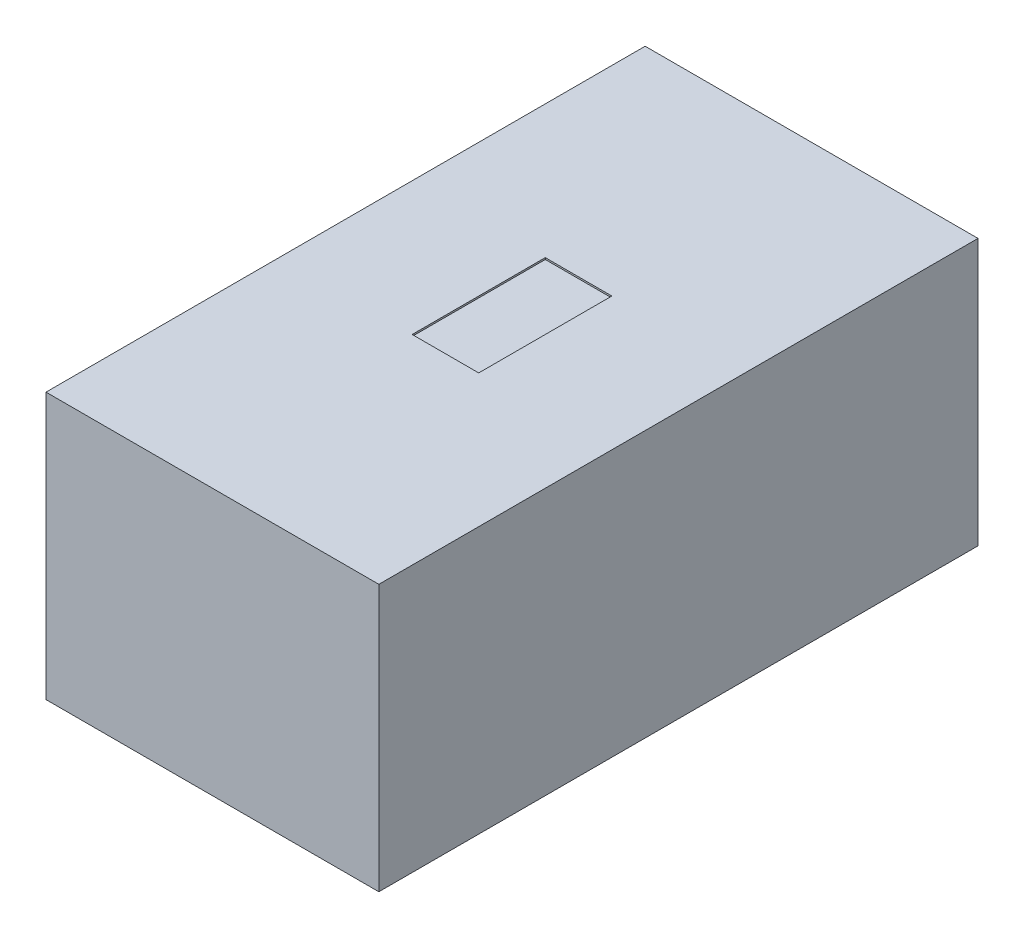
ISO-10303-21;
HEADER;
FILE_DESCRIPTION(('STEP AP214'),'2;1');
FILE_NAME('part.step','',(''),(''),'','','');
FILE_SCHEMA(('AUTOMOTIVE_DESIGN { 1 0 10303 214 1 1 1 1 }'));
ENDSEC;
DATA;
#1=APPLICATION_CONTEXT('core data for automotive mechanical design processes');
#2=APPLICATION_PROTOCOL_DEFINITION('international standard','automotive_design',2000,#1);
#3=PRODUCT_CONTEXT('',#1,'mechanical');
#4=PRODUCT('Part','Part','',(#3));
#5=PRODUCT_RELATED_PRODUCT_CATEGORY('part','',(#4));
#6=PRODUCT_DEFINITION_FORMATION('','',#4);
#7=PRODUCT_DEFINITION_CONTEXT('part definition',#1,'design');
#8=PRODUCT_DEFINITION('design','',#6,#7);
#9=PRODUCT_DEFINITION_SHAPE('','',#8);
#10=(LENGTH_UNIT() NAMED_UNIT(*) SI_UNIT(.MILLI.,.METRE.));
#11=(NAMED_UNIT(*) PLANE_ANGLE_UNIT() SI_UNIT($,.RADIAN.));
#12=(NAMED_UNIT(*) SI_UNIT($,.STERADIAN.) SOLID_ANGLE_UNIT());
#13=UNCERTAINTY_MEASURE_WITH_UNIT(LENGTH_MEASURE(1.E-05),#10,'distance_accuracy_value','');
#14=(GEOMETRIC_REPRESENTATION_CONTEXT(3) GLOBAL_UNCERTAINTY_ASSIGNED_CONTEXT((#13)) GLOBAL_UNIT_ASSIGNED_CONTEXT((#10,
#11,#12)) REPRESENTATION_CONTEXT('',''));
#15=CARTESIAN_POINT('',(0.,0.,0.));
#16=DIRECTION('',(0.,0.,1.));
#17=DIRECTION('',(1.,0.,0.));
#18=AXIS2_PLACEMENT_3D('',#15,#16,#17);
#19=CARTESIAN_POINT('',(0.5,0.8,-0.9));
#20=DIRECTION('',(-1.,0.,0.));
#21=DIRECTION('',(0.,0.,1.));
#22=AXIS2_PLACEMENT_3D('',#19,#20,#21);
#23=PLANE('',#22);
#24=DIRECTION('',(0.,0.,-1.));
#25=VECTOR('',#24,1.);
#26=CARTESIAN_POINT('',(0.5,0.,-0.9));
#27=LINE('',#26,#25);
#28=CARTESIAN_POINT('',(0.5,0.,0.9));
#29=VERTEX_POINT('',#28);
#30=CARTESIAN_POINT('',(0.5,0.,-0.9));
#31=VERTEX_POINT('',#30);
#32=EDGE_CURVE('E141',#29,#31,#27,.T.);
#33=ORIENTED_EDGE('',*,*,#32,.T.);
#34=DIRECTION('',(0.,-1.,0.));
#35=VECTOR('',#34,1.);
#36=CARTESIAN_POINT('',(0.5,0.8,-0.9));
#37=LINE('',#36,#35);
#38=CARTESIAN_POINT('',(0.5,0.8,-0.9));
#39=VERTEX_POINT('',#38);
#40=EDGE_CURVE('E11',#39,#31,#37,.T.);
#41=ORIENTED_EDGE('',*,*,#40,.F.);
#42=DIRECTION('',(0.,0.,-1.));
#43=VECTOR('',#42,1.);
#44=CARTESIAN_POINT('',(0.5,0.8,-0.9));
#45=LINE('',#44,#43);
#46=CARTESIAN_POINT('',(0.5,0.8,0.9));
#47=VERTEX_POINT('',#46);
#48=EDGE_CURVE('E145',#47,#39,#45,.T.);
#49=ORIENTED_EDGE('',*,*,#48,.F.);
#50=DIRECTION('',(0.,-1.,0.));
#51=VECTOR('',#50,1.);
#52=CARTESIAN_POINT('',(0.5,0.8,0.9));
#53=LINE('',#52,#51);
#54=EDGE_CURVE('E151',#47,#29,#53,.T.);
#55=ORIENTED_EDGE('',*,*,#54,.T.);
#56=EDGE_LOOP('',(#33,#41,#49,#55));
#57=FACE_BOUND('',#56,.T.);
#58=ADVANCED_FACE('F33',(#57),#23,.F.);
#59=CARTESIAN_POINT('',(-0.5,0.8,-0.9));
#60=DIRECTION('',(0.,0.,1.));
#61=DIRECTION('',(1.,0.,0.));
#62=AXIS2_PLACEMENT_3D('',#59,#60,#61);
#63=PLANE('',#62);
#64=DIRECTION('',(-1.,0.,0.));
#65=VECTOR('',#64,1.);
#66=CARTESIAN_POINT('',(-0.5,0.,-0.9));
#67=LINE('',#66,#65);
#68=CARTESIAN_POINT('',(-0.5,0.,-0.9));
#69=VERTEX_POINT('',#68);
#70=EDGE_CURVE('E154',#31,#69,#67,.T.);
#71=ORIENTED_EDGE('',*,*,#70,.T.);
#72=DIRECTION('',(0.,-1.,0.));
#73=VECTOR('',#72,1.);
#74=CARTESIAN_POINT('',(-0.5,0.8,-0.9));
#75=LINE('',#74,#73);
#76=CARTESIAN_POINT('',(-0.5,0.8,-0.9));
#77=VERTEX_POINT('',#76);
#78=EDGE_CURVE('E40',#77,#69,#75,.T.);
#79=ORIENTED_EDGE('',*,*,#78,.F.);
#80=DIRECTION('',(-1.,0.,0.));
#81=VECTOR('',#80,1.);
#82=CARTESIAN_POINT('',(-0.5,0.8,-0.9));
#83=LINE('',#82,#81);
#84=EDGE_CURVE('E84',#39,#77,#83,.T.);
#85=ORIENTED_EDGE('',*,*,#84,.F.);
#86=ORIENTED_EDGE('',*,*,#40,.T.);
#87=EDGE_LOOP('',(#71,#79,#85,#86));
#88=FACE_BOUND('',#87,.T.);
#89=ADVANCED_FACE('F183',(#88),#63,.F.);
#90=CARTESIAN_POINT('',(-0.5,0.8,-0.9));
#91=DIRECTION('',(1.,0.,0.));
#92=DIRECTION('',(0.,0.,-1.));
#93=AXIS2_PLACEMENT_3D('',#90,#91,#92);
#94=PLANE('',#93);
#95=DIRECTION('',(0.,0.,1.));
#96=VECTOR('',#95,1.);
#97=CARTESIAN_POINT('',(-0.5,0.,-0.9));
#98=LINE('',#97,#96);
#99=CARTESIAN_POINT('',(-0.5,0.,0.9));
#100=VERTEX_POINT('',#99);
#101=EDGE_CURVE('E156',#69,#100,#98,.T.);
#102=ORIENTED_EDGE('',*,*,#101,.T.);
#103=DIRECTION('',(0.,-1.,0.));
#104=VECTOR('',#103,1.);
#105=CARTESIAN_POINT('',(-0.5,0.8,0.9));
#106=LINE('',#105,#104);
#107=CARTESIAN_POINT('',(-0.5,0.8,0.9));
#108=VERTEX_POINT('',#107);
#109=EDGE_CURVE('E160',#108,#100,#106,.T.);
#110=ORIENTED_EDGE('',*,*,#109,.F.);
#111=DIRECTION('',(0.,0.,1.));
#112=VECTOR('',#111,1.);
#113=CARTESIAN_POINT('',(-0.5,0.8,-0.9));
#114=LINE('',#113,#112);
#115=EDGE_CURVE('E148',#77,#108,#114,.T.);
#116=ORIENTED_EDGE('',*,*,#115,.F.);
#117=ORIENTED_EDGE('',*,*,#78,.T.);
#118=EDGE_LOOP('',(#102,#110,#116,#117));
#119=FACE_BOUND('',#118,.T.);
#120=ADVANCED_FACE('F165',(#119),#94,.F.);
#121=CARTESIAN_POINT('',(-0.5,0.8,0.9));
#122=DIRECTION('',(0.,0.,-1.));
#123=DIRECTION('',(-1.,0.,0.));
#124=AXIS2_PLACEMENT_3D('',#121,#122,#123);
#125=PLANE('',#124);
#126=DIRECTION('',(1.,0.,0.));
#127=VECTOR('',#126,1.);
#128=CARTESIAN_POINT('',(-0.5,0.,0.9));
#129=LINE('',#128,#127);
#130=EDGE_CURVE('E77',#100,#29,#129,.T.);
#131=ORIENTED_EDGE('',*,*,#130,.T.);
#132=ORIENTED_EDGE('',*,*,#54,.F.);
#133=DIRECTION('',(1.,0.,0.));
#134=VECTOR('',#133,1.);
#135=CARTESIAN_POINT('',(-0.5,0.8,0.9));
#136=LINE('',#135,#134);
#137=EDGE_CURVE('E56',#108,#47,#136,.T.);
#138=ORIENTED_EDGE('',*,*,#137,.F.);
#139=ORIENTED_EDGE('',*,*,#109,.T.);
#140=EDGE_LOOP('',(#131,#132,#138,#139));
#141=FACE_BOUND('',#140,.T.);
#142=ADVANCED_FACE('F173',(#141),#125,.F.);
#143=CARTESIAN_POINT('',(0.,0.8,0.));
#144=DIRECTION('',(0.,1.,0.));
#145=DIRECTION('',(0.,0.,1.));
#146=AXIS2_PLACEMENT_3D('',#143,#144,#145);
#147=PLANE('',#146);
#148=DIRECTION('',(0.,0.,-1.));
#149=VECTOR('',#148,1.);
#150=CARTESIAN_POINT('',(0.1,0.8,-0.2));
#151=LINE('',#150,#149);
#152=CARTESIAN_POINT('',(0.1,0.8,0.2));
#153=VERTEX_POINT('',#152);
#154=CARTESIAN_POINT('',(0.1,0.8,-0.2));
#155=VERTEX_POINT('',#154);
#156=EDGE_CURVE('E47',#153,#155,#151,.T.);
#157=ORIENTED_EDGE('',*,*,#156,.F.);
#158=DIRECTION('',(1.,0.,0.));
#159=VECTOR('',#158,1.);
#160=CARTESIAN_POINT('',(-0.1,0.8,0.2));
#161=LINE('',#160,#159);
#162=CARTESIAN_POINT('',(-0.1,0.8,0.2));
#163=VERTEX_POINT('',#162);
#164=EDGE_CURVE('E126',#163,#153,#161,.T.);
#165=ORIENTED_EDGE('',*,*,#164,.F.);
#166=DIRECTION('',(0.,0.,1.));
#167=VECTOR('',#166,1.);
#168=CARTESIAN_POINT('',(-0.1,0.8,-0.2));
#169=LINE('',#168,#167);
#170=CARTESIAN_POINT('',(-0.1,0.8,-0.2));
#171=VERTEX_POINT('',#170);
#172=EDGE_CURVE('E129',#171,#163,#169,.T.);
#173=ORIENTED_EDGE('',*,*,#172,.F.);
#174=DIRECTION('',(-1.,0.,0.));
#175=VECTOR('',#174,1.);
#176=CARTESIAN_POINT('',(-0.1,0.8,-0.2));
#177=LINE('',#176,#175);
#178=EDGE_CURVE('E135',#155,#171,#177,.T.);
#179=ORIENTED_EDGE('',*,*,#178,.F.);
#180=EDGE_LOOP('',(#157,#165,#173,#179));
#181=FACE_BOUND('',#180,.T.);
#182=ORIENTED_EDGE('',*,*,#48,.T.);
#183=ORIENTED_EDGE('',*,*,#84,.T.);
#184=ORIENTED_EDGE('',*,*,#115,.T.);
#185=ORIENTED_EDGE('',*,*,#137,.T.);
#186=EDGE_LOOP('',(#182,#183,#184,#185));
#187=FACE_BOUND('',#186,.T.);
#188=ADVANCED_FACE('F175',(#181,#187),#147,.T.);
#189=CARTESIAN_POINT('',(0.,0.,0.));
#190=DIRECTION('',(0.,1.,0.));
#191=DIRECTION('',(0.,0.,1.));
#192=AXIS2_PLACEMENT_3D('',#189,#190,#191);
#193=PLANE('',#192);
#194=ORIENTED_EDGE('',*,*,#32,.F.);
#195=ORIENTED_EDGE('',*,*,#130,.F.);
#196=ORIENTED_EDGE('',*,*,#101,.F.);
#197=ORIENTED_EDGE('',*,*,#70,.F.);
#198=EDGE_LOOP('',(#194,#195,#196,#197));
#199=FACE_BOUND('',#198,.T.);
#200=ADVANCED_FACE('F169',(#199),#193,.F.);
#201=CARTESIAN_POINT('',(0.1,0.795,-0.2));
#202=DIRECTION('',(1.,0.,0.));
#203=DIRECTION('',(0.,0.,-1.));
#204=AXIS2_PLACEMENT_3D('',#201,#202,#203);
#205=PLANE('',#204);
#206=ORIENTED_EDGE('',*,*,#156,.T.);
#207=DIRECTION('',(0.,1.,0.));
#208=VECTOR('',#207,1.);
#209=CARTESIAN_POINT('',(0.1,0.795,-0.2));
#210=LINE('',#209,#208);
#211=CARTESIAN_POINT('',(0.1,0.795,-0.2));
#212=VERTEX_POINT('',#211);
#213=EDGE_CURVE('E104',#212,#155,#210,.T.);
#214=ORIENTED_EDGE('',*,*,#213,.F.);
#215=DIRECTION('',(0.,0.,-1.));
#216=VECTOR('',#215,1.);
#217=CARTESIAN_POINT('',(0.1,0.795,-0.2));
#218=LINE('',#217,#216);
#219=CARTESIAN_POINT('',(0.1,0.795,0.2));
#220=VERTEX_POINT('',#219);
#221=EDGE_CURVE('E108',#220,#212,#218,.T.);
#222=ORIENTED_EDGE('',*,*,#221,.F.);
#223=DIRECTION('',(0.,1.,0.));
#224=VECTOR('',#223,1.);
#225=CARTESIAN_POINT('',(0.1,0.795,0.2));
#226=LINE('',#225,#224);
#227=EDGE_CURVE('E139',#220,#153,#226,.T.);
#228=ORIENTED_EDGE('',*,*,#227,.T.);
#229=EDGE_LOOP('',(#206,#214,#222,#228));
#230=FACE_BOUND('',#229,.T.);
#231=ADVANCED_FACE('F106',(#230),#205,.F.);
#232=CARTESIAN_POINT('',(-0.1,0.795,0.2));
#233=DIRECTION('',(0.,0.,1.));
#234=DIRECTION('',(1.,0.,0.));
#235=AXIS2_PLACEMENT_3D('',#232,#233,#234);
#236=PLANE('',#235);
#237=ORIENTED_EDGE('',*,*,#164,.T.);
#238=ORIENTED_EDGE('',*,*,#227,.F.);
#239=DIRECTION('',(1.,0.,0.));
#240=VECTOR('',#239,1.);
#241=CARTESIAN_POINT('',(-0.1,0.795,0.2));
#242=LINE('',#241,#240);
#243=CARTESIAN_POINT('',(-0.1,0.795,0.2));
#244=VERTEX_POINT('',#243);
#245=EDGE_CURVE('E114',#244,#220,#242,.T.);
#246=ORIENTED_EDGE('',*,*,#245,.F.);
#247=DIRECTION('',(0.,1.,0.));
#248=VECTOR('',#247,1.);
#249=CARTESIAN_POINT('',(-0.1,0.795,0.2));
#250=LINE('',#249,#248);
#251=EDGE_CURVE('E142',#244,#163,#250,.T.);
#252=ORIENTED_EDGE('',*,*,#251,.T.);
#253=EDGE_LOOP('',(#237,#238,#246,#252));
#254=FACE_BOUND('',#253,.T.);
#255=ADVANCED_FACE('F222',(#254),#236,.F.);
#256=CARTESIAN_POINT('',(-0.1,0.795,-0.2));
#257=DIRECTION('',(-1.,0.,0.));
#258=DIRECTION('',(0.,0.,1.));
#259=AXIS2_PLACEMENT_3D('',#256,#257,#258);
#260=PLANE('',#259);
#261=ORIENTED_EDGE('',*,*,#172,.T.);
#262=ORIENTED_EDGE('',*,*,#251,.F.);
#263=DIRECTION('',(0.,0.,1.));
#264=VECTOR('',#263,1.);
#265=CARTESIAN_POINT('',(-0.1,0.795,-0.2));
#266=LINE('',#265,#264);
#267=CARTESIAN_POINT('',(-0.1,0.795,-0.2));
#268=VERTEX_POINT('',#267);
#269=EDGE_CURVE('E122',#268,#244,#266,.T.);
#270=ORIENTED_EDGE('',*,*,#269,.F.);
#271=DIRECTION('',(0.,1.,0.));
#272=VECTOR('',#271,1.);
#273=CARTESIAN_POINT('',(-0.1,0.795,-0.2));
#274=LINE('',#273,#272);
#275=EDGE_CURVE('E113',#268,#171,#274,.T.);
#276=ORIENTED_EDGE('',*,*,#275,.T.);
#277=EDGE_LOOP('',(#261,#262,#270,#276));
#278=FACE_BOUND('',#277,.T.);
#279=ADVANCED_FACE('F231',(#278),#260,.F.);
#280=CARTESIAN_POINT('',(-0.1,0.795,-0.2));
#281=DIRECTION('',(0.,0.,-1.));
#282=DIRECTION('',(-1.,0.,0.));
#283=AXIS2_PLACEMENT_3D('',#280,#281,#282);
#284=PLANE('',#283);
#285=ORIENTED_EDGE('',*,*,#178,.T.);
#286=ORIENTED_EDGE('',*,*,#275,.F.);
#287=DIRECTION('',(-1.,0.,0.));
#288=VECTOR('',#287,1.);
#289=CARTESIAN_POINT('',(-0.1,0.795,-0.2));
#290=LINE('',#289,#288);
#291=EDGE_CURVE('E117',#212,#268,#290,.T.);
#292=ORIENTED_EDGE('',*,*,#291,.F.);
#293=ORIENTED_EDGE('',*,*,#213,.T.);
#294=EDGE_LOOP('',(#285,#286,#292,#293));
#295=FACE_BOUND('',#294,.T.);
#296=ADVANCED_FACE('F118',(#295),#284,.F.);
#297=CARTESIAN_POINT('',(0.,0.795,0.));
#298=DIRECTION('',(0.,1.,0.));
#299=DIRECTION('',(0.,0.,1.));
#300=AXIS2_PLACEMENT_3D('',#297,#298,#299);
#301=PLANE('',#300);
#302=ORIENTED_EDGE('',*,*,#221,.T.);
#303=ORIENTED_EDGE('',*,*,#291,.T.);
#304=ORIENTED_EDGE('',*,*,#269,.T.);
#305=ORIENTED_EDGE('',*,*,#245,.T.);
#306=EDGE_LOOP('',(#302,#303,#304,#305));
#307=FACE_BOUND('',#306,.T.);
#308=ADVANCED_FACE('F124',(#307),#301,.T.);
#309=CLOSED_SHELL('',(#58,#89,#120,#142,#188,#200,#231,#255,#279,#296,#308));
#310=MANIFOLD_SOLID_BREP('B2',#309);
#311=ADVANCED_BREP_SHAPE_REPRESENTATION('',(#18,#310),#14);
#312=SHAPE_DEFINITION_REPRESENTATION(#9,#311);
ENDSEC;
END-ISO-10303-21;
